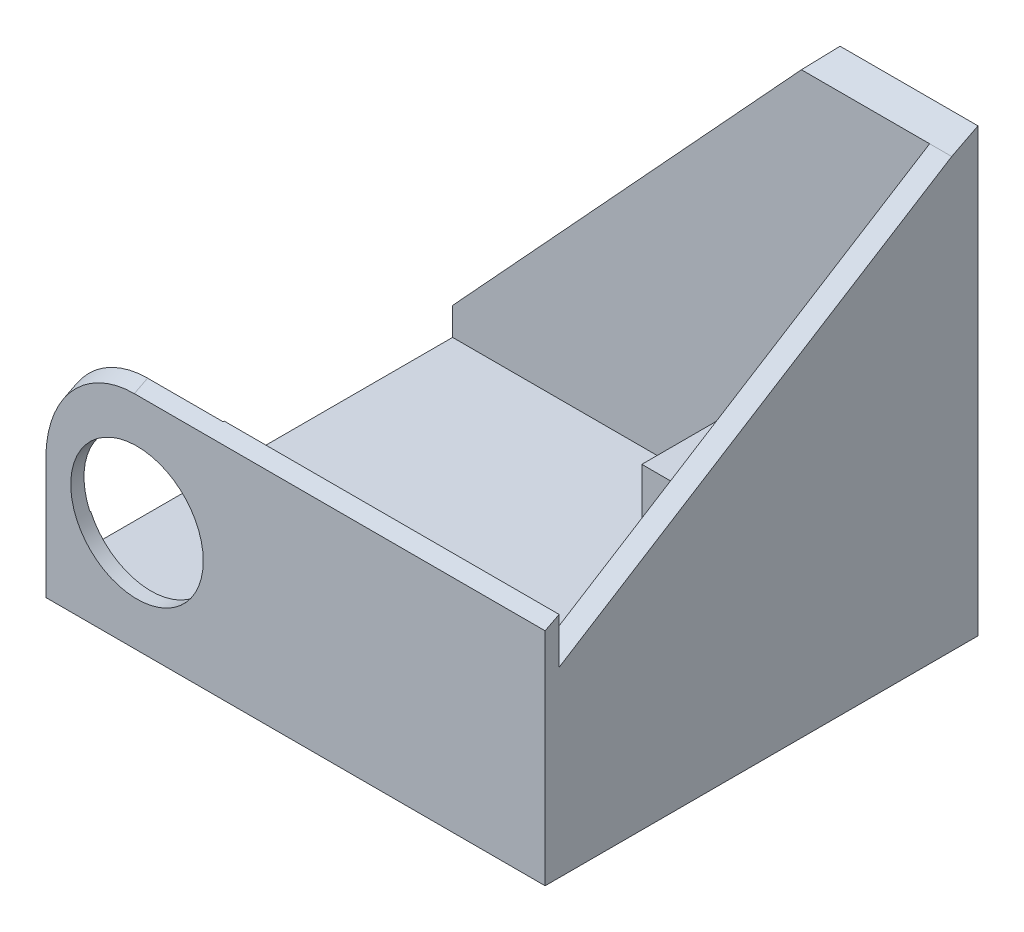
ISO-10303-21;
HEADER;
FILE_DESCRIPTION(('STEP AP214'),'2;1');
FILE_NAME('part.step','',(''),(''),'','','');
FILE_SCHEMA(('AUTOMOTIVE_DESIGN { 1 0 10303 214 1 1 1 1 }'));
ENDSEC;
DATA;
#1=APPLICATION_CONTEXT('core data for automotive mechanical design processes');
#2=APPLICATION_PROTOCOL_DEFINITION('international standard','automotive_design',2000,#1);
#3=PRODUCT_CONTEXT('',#1,'mechanical');
#4=PRODUCT('Part','Part','',(#3));
#5=PRODUCT_RELATED_PRODUCT_CATEGORY('part','',(#4));
#6=PRODUCT_DEFINITION_FORMATION('','',#4);
#7=PRODUCT_DEFINITION_CONTEXT('part definition',#1,'design');
#8=PRODUCT_DEFINITION('design','',#6,#7);
#9=PRODUCT_DEFINITION_SHAPE('','',#8);
#10=(LENGTH_UNIT() NAMED_UNIT(*) SI_UNIT(.MILLI.,.METRE.));
#11=(NAMED_UNIT(*) PLANE_ANGLE_UNIT() SI_UNIT($,.RADIAN.));
#12=(NAMED_UNIT(*) SI_UNIT($,.STERADIAN.) SOLID_ANGLE_UNIT());
#13=UNCERTAINTY_MEASURE_WITH_UNIT(LENGTH_MEASURE(1.E-05),#10,'distance_accuracy_value','');
#14=(GEOMETRIC_REPRESENTATION_CONTEXT(3) GLOBAL_UNCERTAINTY_ASSIGNED_CONTEXT((#13)) GLOBAL_UNIT_ASSIGNED_CONTEXT((#10,
#11,#12)) REPRESENTATION_CONTEXT('',''));
#15=CARTESIAN_POINT('',(0.,0.,0.));
#16=DIRECTION('',(0.,0.,1.));
#17=DIRECTION('',(1.,0.,0.));
#18=AXIS2_PLACEMENT_3D('',#15,#16,#17);
#19=CARTESIAN_POINT('',(34.3973116805746,0.,74.7961538461538));
#20=DIRECTION('',(0.735365944028076,-0.677670220950941,0.));
#21=DIRECTION('',(0.677670220950941,0.735365944028076,0.));
#22=AXIS2_PLACEMENT_3D('',#19,#20,#21);
#23=PLANE('',#22);
#24=DIRECTION('',(-0.677670220950941,-0.735365944028076,0.));
#25=VECTOR('',#24,1.);
#26=CARTESIAN_POINT('',(34.3973116805746,0.,74.622940805523));
#27=LINE('',#26,#25);
#28=CARTESIAN_POINT('',(-10.1877993750724,-48.3810137547802,74.622940805523));
#29=VERTEX_POINT('',#28);
#30=CARTESIAN_POINT('',(-21.706851972046,-60.8807794599871,74.622940805523));
#31=VERTEX_POINT('',#30);
#32=EDGE_CURVE('E195',#29,#31,#27,.T.);
#33=ORIENTED_EDGE('',*,*,#32,.T.);
#34=DIRECTION('',(0.,0.,1.));
#35=VECTOR('',#34,1.);
#36=CARTESIAN_POINT('',(-21.706851972046,-60.8807794599871,52.7961538461538));
#37=LINE('',#36,#35);
#38=CARTESIAN_POINT('',(-21.706851972046,-60.8807794599871,74.7961538461538));
#39=VERTEX_POINT('',#38);
#40=EDGE_CURVE('E172',#31,#39,#37,.T.);
#41=ORIENTED_EDGE('',*,*,#40,.T.);
#42=DIRECTION('',(-0.677670220950941,-0.735365944028076,0.));
#43=VECTOR('',#42,1.);
#44=CARTESIAN_POINT('',(34.3973116805746,0.,74.7961538461538));
#45=LINE('',#44,#43);
#46=CARTESIAN_POINT('',(-10.2692396821886,-48.4693877551021,74.7961538461538));
#47=VERTEX_POINT('',#46);
#48=EDGE_CURVE('E278',#47,#39,#45,.T.);
#49=ORIENTED_EDGE('',*,*,#48,.F.);
#50=DIRECTION('',(-0.386301816628273,-0.419190915112051,0.821614193619619));
#51=VECTOR('',#50,1.);
#52=CARTESIAN_POINT('',(19.6578961216158,-15.9943050496246,11.144991743418));
#53=LINE('',#52,#51);
#54=EDGE_CURVE('E201',#29,#47,#53,.T.);
#55=ORIENTED_EDGE('',*,*,#54,.F.);
#56=EDGE_LOOP('',(#33,#41,#49,#55));
#57=FACE_BOUND('',#56,.T.);
#58=ADVANCED_FACE('F39',(#57),#23,.F.);
#59=CARTESIAN_POINT('',(-47.3730769230769,-95.,-14.2532520853755));
#60=DIRECTION('',(0.,0.,-1.));
#61=DIRECTION('',(-1.,0.,0.));
#62=AXIS2_PLACEMENT_3D('',#59,#60,#61);
#63=PLANE('',#62);
#64=DIRECTION('',(0.,-1.,0.));
#65=VECTOR('',#64,1.);
#66=CARTESIAN_POINT('',(23.9396218920728,-70.,-14.2532520853755));
#67=LINE('',#66,#65);
#68=CARTESIAN_POINT('',(23.9396218920728,-70.,-14.2532520853755));
#69=VERTEX_POINT('',#68);
#70=CARTESIAN_POINT('',(23.9396218920728,-95.,-14.2532520853755));
#71=VERTEX_POINT('',#70);
#72=EDGE_CURVE('E411',#69,#71,#67,.T.);
#73=ORIENTED_EDGE('',*,*,#72,.F.);
#74=DIRECTION('',(-1.,0.,0.));
#75=VECTOR('',#74,1.);
#76=CARTESIAN_POINT('',(23.9396218920728,-70.,-14.2532520853755));
#77=LINE('',#76,#75);
#78=CARTESIAN_POINT('',(60.626923076923,-70.,-14.2532520853755));
#79=VERTEX_POINT('',#78);
#80=EDGE_CURVE('E414',#79,#69,#77,.T.);
#81=ORIENTED_EDGE('',*,*,#80,.F.);
#82=DIRECTION('',(0.,1.,0.));
#83=VECTOR('',#82,1.);
#84=CARTESIAN_POINT('',(60.626923076923,-95.,-14.2532520853755));
#85=LINE('',#84,#83);
#86=CARTESIAN_POINT('',(60.626923076923,-3.03601738187281,-14.2532520853755));
#87=VERTEX_POINT('',#86);
#88=EDGE_CURVE('E399',#79,#87,#85,.T.);
#89=ORIENTED_EDGE('',*,*,#88,.T.);
#90=DIRECTION('',(1.,0.,0.));
#91=VECTOR('',#90,1.);
#92=CARTESIAN_POINT('',(-64.3730769230769,-3.03601738187279,-14.2532520853755));
#93=LINE('',#92,#91);
#94=CARTESIAN_POINT('',(31.5994957269082,-3.03601738187281,-14.2532520853755));
#95=VERTEX_POINT('',#94);
#96=EDGE_CURVE('E288',#95,#87,#93,.T.);
#97=ORIENTED_EDGE('',*,*,#96,.F.);
#98=DIRECTION('',(0.677670220950941,0.735365944028076,0.));
#99=VECTOR('',#98,1.);
#100=CARTESIAN_POINT('',(34.3973116805746,0.,-14.2532520853755));
#101=LINE('',#100,#99);
#102=CARTESIAN_POINT('',(-47.3730769230769,-88.732184401858,-14.2532520853755));
#103=VERTEX_POINT('',#102);
#104=EDGE_CURVE('E178',#103,#95,#101,.T.);
#105=ORIENTED_EDGE('',*,*,#104,.F.);
#106=DIRECTION('',(0.,1.,0.));
#107=VECTOR('',#106,1.);
#108=CARTESIAN_POINT('',(-47.3730769230769,-95.,-14.2532520853755));
#109=LINE('',#108,#107);
#110=CARTESIAN_POINT('',(-47.3730769230769,-95.,-14.2532520853755));
#111=VERTEX_POINT('',#110);
#112=EDGE_CURVE('E303',#111,#103,#109,.T.);
#113=ORIENTED_EDGE('',*,*,#112,.F.);
#114=DIRECTION('',(-1.,0.,0.));
#115=VECTOR('',#114,1.);
#116=CARTESIAN_POINT('',(-47.3730769230769,-95.,-14.2532520853755));
#117=LINE('',#116,#115);
#118=EDGE_CURVE('E371',#71,#111,#117,.T.);
#119=ORIENTED_EDGE('',*,*,#118,.F.);
#120=EDGE_LOOP('',(#73,#81,#89,#97,#105,#113,#119));
#121=FACE_BOUND('',#120,.T.);
#122=ADVANCED_FACE('F323',(#121),#63,.F.);
#123=CARTESIAN_POINT('',(0.,-95.,0.));
#124=DIRECTION('',(0.,1.,0.));
#125=DIRECTION('',(0.,0.,1.));
#126=AXIS2_PLACEMENT_3D('',#123,#124,#125);
#127=PLANE('',#126);
#128=DIRECTION('',(1.,0.,0.));
#129=VECTOR('',#128,1.);
#130=CARTESIAN_POINT('',(23.9396218920728,-95.,14.2149034499911));
#131=LINE('',#130,#129);
#132=CARTESIAN_POINT('',(23.9396218920728,-95.,14.2149034499911));
#133=VERTEX_POINT('',#132);
#134=CARTESIAN_POINT('',(60.626923076923,-95.,14.2149034499911));
#135=VERTEX_POINT('',#134);
#136=EDGE_CURVE('E415',#133,#135,#131,.T.);
#137=ORIENTED_EDGE('',*,*,#136,.F.);
#138=DIRECTION('',(0.,0.,1.));
#139=VECTOR('',#138,1.);
#140=CARTESIAN_POINT('',(23.9396218920728,-95.,-14.2532520853755));
#141=LINE('',#140,#139);
#142=EDGE_CURVE('E419',#71,#133,#141,.T.);
#143=ORIENTED_EDGE('',*,*,#142,.F.);
#144=ORIENTED_EDGE('',*,*,#118,.T.);
#145=DIRECTION('',(0.,0.,1.));
#146=VECTOR('',#145,1.);
#147=CARTESIAN_POINT('',(-47.3730769230769,-95.,-14.2532520853755));
#148=LINE('',#147,#146);
#149=CARTESIAN_POINT('',(-47.3730769230769,-95.,74.622940805523));
#150=VERTEX_POINT('',#149);
#151=EDGE_CURVE('E379',#111,#150,#148,.T.);
#152=ORIENTED_EDGE('',*,*,#151,.T.);
#153=DIRECTION('',(1.,0.,0.));
#154=VECTOR('',#153,1.);
#155=CARTESIAN_POINT('',(-47.3730769230769,-95.,74.622940805523));
#156=LINE('',#155,#154);
#157=CARTESIAN_POINT('',(60.6269230769231,-95.,74.622940805523));
#158=VERTEX_POINT('',#157);
#159=EDGE_CURVE('E375',#150,#158,#156,.T.);
#160=ORIENTED_EDGE('',*,*,#159,.T.);
#161=DIRECTION('',(0.,0.,-1.));
#162=VECTOR('',#161,1.);
#163=CARTESIAN_POINT('',(60.6269230769231,-95.,74.622940805523));
#164=LINE('',#163,#162);
#165=EDGE_CURVE('E391',#158,#135,#164,.T.);
#166=ORIENTED_EDGE('',*,*,#165,.T.);
#167=EDGE_LOOP('',(#137,#143,#144,#152,#160,#166));
#168=FACE_BOUND('',#167,.T.);
#169=ADVANCED_FACE('F328',(#168),#127,.T.);
#170=CARTESIAN_POINT('',(60.626923076923,0.,0.));
#171=DIRECTION('',(1.,0.,0.));
#172=DIRECTION('',(0.,0.,-1.));
#173=AXIS2_PLACEMENT_3D('',#170,#171,#172);
#174=PLANE('',#173);
#175=DIRECTION('',(0.,-1.,0.));
#176=VECTOR('',#175,1.);
#177=CARTESIAN_POINT('',(60.626923076923,-70.,14.2149034499911));
#178=LINE('',#177,#176);
#179=CARTESIAN_POINT('',(60.6269230769231,-70.,14.2149034499911));
#180=VERTEX_POINT('',#179);
#181=EDGE_CURVE('E407',#180,#135,#178,.T.);
#182=ORIENTED_EDGE('',*,*,#181,.T.);
#183=ORIENTED_EDGE('',*,*,#165,.F.);
#184=DIRECTION('',(0.,-1.,0.));
#185=VECTOR('',#184,1.);
#186=CARTESIAN_POINT('',(60.6269230769231,-58.7383586760286,74.622940805523));
#187=LINE('',#186,#185);
#188=CARTESIAN_POINT('',(60.6269230769231,-58.7383586760286,74.622940805523));
#189=VERTEX_POINT('',#188);
#190=EDGE_CURVE('E386',#189,#158,#187,.T.);
#191=ORIENTED_EDGE('',*,*,#190,.F.);
#192=DIRECTION('',(0.,-0.531059263131155,0.847334679475941));
#193=VECTOR('',#192,1.);
#194=CARTESIAN_POINT('',(60.626923076923,-3.03601738187284,-14.2532520853755));
#195=LINE('',#194,#193);
#196=EDGE_CURVE('E395',#87,#189,#195,.T.);
#197=ORIENTED_EDGE('',*,*,#196,.F.);
#198=ORIENTED_EDGE('',*,*,#88,.F.);
#199=DIRECTION('',(0.,0.,-1.));
#200=VECTOR('',#199,1.);
#201=CARTESIAN_POINT('',(60.626923076923,-70.,-14.2532520853755));
#202=LINE('',#201,#200);
#203=EDGE_CURVE('E426',#180,#79,#202,.T.);
#204=ORIENTED_EDGE('',*,*,#203,.F.);
#205=EDGE_LOOP('',(#182,#183,#191,#197,#198,#204));
#206=FACE_BOUND('',#205,.T.);
#207=ADVANCED_FACE('F345',(#206),#174,.F.);
#208=CARTESIAN_POINT('',(-64.3730769230769,0.,-20.2038461538461));
#209=DIRECTION('',(0.,-0.890761869708233,-0.454470341687874));
#210=DIRECTION('',(0.,0.454470341687874,-0.890761869708233));
#211=AXIS2_PLACEMENT_3D('',#208,#209,#210);
#212=PLANE('',#211);
#213=CARTESIAN_POINT('',(34.3973116805746,0.,-20.2038461538462));
#214=VERTEX_POINT('',#213);
#215=EDGE_CURVE('E196',#214,#95,#53,.T.);
#216=ORIENTED_EDGE('',*,*,#215,.T.);
#217=ORIENTED_EDGE('',*,*,#96,.T.);
#218=DIRECTION('',(1.,0.,0.));
#219=VECTOR('',#218,1.);
#220=CARTESIAN_POINT('',(60.626923076923,-3.03601738187284,-14.2532520853755));
#221=LINE('',#220,#219);
#222=CARTESIAN_POINT('',(65.6269230769231,-3.03601738187284,-14.2532520853755));
#223=VERTEX_POINT('',#222);
#224=EDGE_CURVE('E355',#87,#223,#221,.T.);
#225=ORIENTED_EDGE('',*,*,#224,.T.);
#226=DIRECTION('',(0.,0.454470341687874,-0.890761869708233));
#227=VECTOR('',#226,1.);
#228=CARTESIAN_POINT('',(65.626923076923,0.,-20.2038461538462));
#229=LINE('',#228,#227);
#230=CARTESIAN_POINT('',(65.626923076923,0.,-20.2038461538462));
#231=VERTEX_POINT('',#230);
#232=EDGE_CURVE('E237',#223,#231,#229,.T.);
#233=ORIENTED_EDGE('',*,*,#232,.T.);
#234=DIRECTION('',(-1.,0.,0.));
#235=VECTOR('',#234,1.);
#236=CARTESIAN_POINT('',(-47.3730769230769,0.,-20.2038461538462));
#237=LINE('',#236,#235);
#238=EDGE_CURVE('E229',#231,#214,#237,.T.);
#239=ORIENTED_EDGE('',*,*,#238,.T.);
#240=EDGE_LOOP('',(#216,#217,#225,#233,#239));
#241=FACE_BOUND('',#240,.T.);
#242=ADVANCED_FACE('F334',(#241),#212,.F.);
#243=DIRECTION('',(0.,0.,-1.));
#244=VECTOR('',#243,1.);
#245=CARTESIAN_POINT('',(-47.3730769230769,-88.732184401858,74.7961538461538));
#246=LINE('',#245,#244);
#247=CARTESIAN_POINT('',(-47.3730769230769,-88.732184401858,-20.2038461538462));
#248=VERTEX_POINT('',#247);
#249=EDGE_CURVE('E284',#103,#248,#246,.T.);
#250=ORIENTED_EDGE('',*,*,#249,.F.);
#251=ORIENTED_EDGE('',*,*,#104,.T.);
#252=ORIENTED_EDGE('',*,*,#215,.F.);
#253=DIRECTION('',(-0.677670220950941,-0.735365944028076,0.));
#254=VECTOR('',#253,1.);
#255=CARTESIAN_POINT('',(34.3973116805746,0.,-20.2038461538462));
#256=LINE('',#255,#254);
#257=EDGE_CURVE('E286',#214,#248,#256,.T.);
#258=ORIENTED_EDGE('',*,*,#257,.T.);
#259=EDGE_LOOP('',(#250,#251,#252,#258));
#260=FACE_BOUND('',#259,.T.);
#261=ADVANCED_FACE('F306',(#260),#23,.F.);
#262=CARTESIAN_POINT('',(-47.3730769230769,-100.,-20.2038461538462));
#263=DIRECTION('',(-1.,0.,0.));
#264=DIRECTION('',(0.,0.,1.));
#265=AXIS2_PLACEMENT_3D('',#262,#263,#264);
#266=PLANE('',#265);
#267=DIRECTION('',(0.,1.,0.));
#268=VECTOR('',#267,1.);
#269=CARTESIAN_POINT('',(-47.3730769230769,-100.,77.7961538461538));
#270=LINE('',#269,#268);
#271=CARTESIAN_POINT('',(-47.3730769230769,-100.,77.7961538461538));
#272=VERTEX_POINT('',#271);
#273=CARTESIAN_POINT('',(-47.3730769230769,-72.4526898603675,77.7961538461538));
#274=VERTEX_POINT('',#273);
#275=EDGE_CURVE('E254',#272,#274,#270,.T.);
#276=ORIENTED_EDGE('',*,*,#275,.T.);
#277=DIRECTION('',(0.,-0.454470341687874,0.890761869708233));
#278=VECTOR('',#277,1.);
#279=CARTESIAN_POINT('',(-47.3730769230769,-66.2846251492667,65.7067470123964));
#280=LINE('',#279,#278);
#281=CARTESIAN_POINT('',(-47.3730769230769,-70.9220776154695,74.7961538461538));
#282=VERTEX_POINT('',#281);
#283=EDGE_CURVE('E48',#274,#282,#280,.F.);
#284=ORIENTED_EDGE('',*,*,#283,.T.);
#285=DIRECTION('',(0.,1.,0.));
#286=VECTOR('',#285,1.);
#287=CARTESIAN_POINT('',(-47.3730769230769,-88.732184401858,74.7961538461538));
#288=LINE('',#287,#286);
#289=CARTESIAN_POINT('',(-47.3730769230769,-88.732184401858,74.7961538461538));
#290=VERTEX_POINT('',#289);
#291=EDGE_CURVE('E280',#290,#282,#288,.T.);
#292=ORIENTED_EDGE('',*,*,#291,.F.);
#293=CARTESIAN_POINT('',(-47.3730769230769,-88.732184401858,74.622940805523));
#294=VERTEX_POINT('',#293);
#295=EDGE_CURVE('E293',#290,#294,#246,.T.);
#296=ORIENTED_EDGE('',*,*,#295,.T.);
#297=DIRECTION('',(0.,1.,0.));
#298=VECTOR('',#297,1.);
#299=CARTESIAN_POINT('',(-47.3730769230769,-95.,74.622940805523));
#300=LINE('',#299,#298);
#301=EDGE_CURVE('E192',#150,#294,#300,.T.);
#302=ORIENTED_EDGE('',*,*,#301,.F.);
#303=ORIENTED_EDGE('',*,*,#151,.F.);
#304=ORIENTED_EDGE('',*,*,#112,.T.);
#305=ORIENTED_EDGE('',*,*,#249,.T.);
#306=DIRECTION('',(0.,1.,0.));
#307=VECTOR('',#306,1.);
#308=CARTESIAN_POINT('',(-47.3730769230769,-100.,-20.2038461538462));
#309=LINE('',#308,#307);
#310=CARTESIAN_POINT('',(-47.3730769230769,-100.,-20.2038461538462));
#311=VERTEX_POINT('',#310);
#312=EDGE_CURVE('E256',#311,#248,#309,.T.);
#313=ORIENTED_EDGE('',*,*,#312,.F.);
#314=DIRECTION('',(0.,0.,1.));
#315=VECTOR('',#314,1.);
#316=CARTESIAN_POINT('',(-47.3730769230769,-100.,-20.2038461538462));
#317=LINE('',#316,#315);
#318=EDGE_CURVE('E235',#311,#272,#317,.T.);
#319=ORIENTED_EDGE('',*,*,#318,.T.);
#320=EDGE_LOOP('',(#276,#284,#292,#296,#302,#303,#304,#305,#313,#319));
#321=FACE_BOUND('',#320,.T.);
#322=ADVANCED_FACE('F299',(#321),#266,.T.);
#323=CARTESIAN_POINT('',(-47.3730769230769,-100.,-20.2038461538462));
#324=DIRECTION('',(0.,0.,-1.));
#325=DIRECTION('',(-1.,0.,0.));
#326=AXIS2_PLACEMENT_3D('',#323,#324,#325);
#327=PLANE('',#326);
#328=ORIENTED_EDGE('',*,*,#257,.F.);
#329=ORIENTED_EDGE('',*,*,#238,.F.);
#330=DIRECTION('',(0.,1.,0.));
#331=VECTOR('',#330,1.);
#332=CARTESIAN_POINT('',(65.626923076923,-100.,-20.2038461538462));
#333=LINE('',#332,#331);
#334=CARTESIAN_POINT('',(65.626923076923,-100.,-20.2038461538462));
#335=VERTEX_POINT('',#334);
#336=EDGE_CURVE('E260',#335,#231,#333,.T.);
#337=ORIENTED_EDGE('',*,*,#336,.F.);
#338=DIRECTION('',(-1.,0.,0.));
#339=VECTOR('',#338,1.);
#340=CARTESIAN_POINT('',(-47.3730769230769,-100.,-20.2038461538462));
#341=LINE('',#340,#339);
#342=EDGE_CURVE('E251',#335,#311,#341,.T.);
#343=ORIENTED_EDGE('',*,*,#342,.T.);
#344=ORIENTED_EDGE('',*,*,#312,.T.);
#345=EDGE_LOOP('',(#328,#329,#337,#343,#344));
#346=FACE_BOUND('',#345,.T.);
#347=ADVANCED_FACE('F309',(#346),#327,.T.);
#348=CARTESIAN_POINT('',(65.626923076923,-100.,-20.2038461538462));
#349=DIRECTION('',(1.,0.,0.));
#350=DIRECTION('',(0.,0.,-1.));
#351=AXIS2_PLACEMENT_3D('',#348,#349,#350);
#352=PLANE('',#351);
#353=ORIENTED_EDGE('',*,*,#232,.F.);
#354=DIRECTION('',(0.,-0.531059263131155,0.847334679475941));
#355=VECTOR('',#354,1.);
#356=CARTESIAN_POINT('',(65.626923076923,-3.03601738187284,-14.2532520853755));
#357=LINE('',#356,#355);
#358=CARTESIAN_POINT('',(65.6269230769231,-58.7383586760286,74.622940805523));
#359=VERTEX_POINT('',#358);
#360=EDGE_CURVE('E361',#223,#359,#357,.T.);
#361=ORIENTED_EDGE('',*,*,#360,.T.);
#362=DIRECTION('',(0.,1.,0.));
#363=VECTOR('',#362,1.);
#364=CARTESIAN_POINT('',(65.6269230769231,-95.,74.622940805523));
#365=LINE('',#364,#363);
#366=CARTESIAN_POINT('',(65.6269230769231,-48.3810137547802,74.622940805523));
#367=VERTEX_POINT('',#366);
#368=EDGE_CURVE('E360',#359,#367,#365,.T.);
#369=ORIENTED_EDGE('',*,*,#368,.T.);
#370=CARTESIAN_POINT('',(65.6269230769231,-50.,77.7961538461538));
#371=VERTEX_POINT('',#370);
#372=EDGE_CURVE('E230',#371,#367,#229,.T.);
#373=ORIENTED_EDGE('',*,*,#372,.F.);
#374=DIRECTION('',(0.,1.,0.));
#375=VECTOR('',#374,1.);
#376=CARTESIAN_POINT('',(65.6269230769231,-100.,77.7961538461538));
#377=LINE('',#376,#375);
#378=CARTESIAN_POINT('',(65.6269230769231,-100.,77.7961538461538));
#379=VERTEX_POINT('',#378);
#380=EDGE_CURVE('E227',#379,#371,#377,.T.);
#381=ORIENTED_EDGE('',*,*,#380,.F.);
#382=DIRECTION('',(0.,0.,-1.));
#383=VECTOR('',#382,1.);
#384=CARTESIAN_POINT('',(65.626923076923,-100.,-20.2038461538462));
#385=LINE('',#384,#383);
#386=EDGE_CURVE('E247',#379,#335,#385,.T.);
#387=ORIENTED_EDGE('',*,*,#386,.T.);
#388=ORIENTED_EDGE('',*,*,#336,.T.);
#389=EDGE_LOOP('',(#353,#361,#369,#373,#381,#387,#388));
#390=FACE_BOUND('',#389,.T.);
#391=ADVANCED_FACE('F359',(#390),#352,.T.);
#392=CARTESIAN_POINT('',(-47.3730769230769,-100.,77.7961538461538));
#393=DIRECTION('',(0.,0.,1.));
#394=DIRECTION('',(1.,0.,0.));
#395=AXIS2_PLACEMENT_3D('',#392,#393,#394);
#396=PLANE('',#395);
#397=CARTESIAN_POINT('',(-26.7711990516286,-75.,77.7961538461538));
#398=DIRECTION('',(0.,0.,1.));
#399=DIRECTION('',(1.,0.,0.));
#400=AXIS2_PLACEMENT_3D('',#397,#398,#399);
#401=CIRCLE('',#400,15.);
#402=CARTESIAN_POINT('',(-11.7711990516286,-75.,77.7961538461538));
#403=VERTEX_POINT('',#402);
#404=EDGE_CURVE('E188',#403,#403,#401,.T.);
#405=ORIENTED_EDGE('',*,*,#404,.F.);
#406=EDGE_LOOP('',(#405));
#407=FACE_BOUND('',#406,.T.);
#408=DIRECTION('',(1.,0.,0.));
#409=VECTOR('',#408,1.);
#410=CARTESIAN_POINT('',(-64.3730769230769,-50.,77.7961538461539));
#411=LINE('',#410,#409);
#412=CARTESIAN_POINT('',(-27.3730769230769,-50.,77.7961538461539));
#413=VERTEX_POINT('',#412);
#414=EDGE_CURVE('E218',#413,#371,#411,.T.);
#415=ORIENTED_EDGE('',*,*,#414,.F.);
#416=CARTESIAN_POINT('',(-27.3730769230769,-72.4526898603674,77.7961538461538));
#417=DIRECTION('',(0.,0.,1.));
#418=DIRECTION('',(0.,1.,0.));
#419=AXIS2_PLACEMENT_3D('',#416,#417,#418);
#420=ELLIPSE('',#419,22.4526898603675,20.);
#421=EDGE_CURVE('E62',#413,#274,#420,.T.);
#422=ORIENTED_EDGE('',*,*,#421,.T.);
#423=ORIENTED_EDGE('',*,*,#275,.F.);
#424=DIRECTION('',(1.,0.,0.));
#425=VECTOR('',#424,1.);
#426=CARTESIAN_POINT('',(-47.3730769230769,-100.,77.7961538461538));
#427=LINE('',#426,#425);
#428=EDGE_CURVE('E244',#272,#379,#427,.T.);
#429=ORIENTED_EDGE('',*,*,#428,.T.);
#430=ORIENTED_EDGE('',*,*,#380,.T.);
#431=EDGE_LOOP('',(#415,#422,#423,#429,#430));
#432=FACE_BOUND('',#431,.T.);
#433=ADVANCED_FACE('F225',(#407,#432),#396,.T.);
#434=CARTESIAN_POINT('',(0.,-100.,0.));
#435=DIRECTION('',(0.,1.,0.));
#436=DIRECTION('',(0.,0.,1.));
#437=AXIS2_PLACEMENT_3D('',#434,#435,#436);
#438=PLANE('',#437);
#439=ORIENTED_EDGE('',*,*,#318,.F.);
#440=ORIENTED_EDGE('',*,*,#342,.F.);
#441=ORIENTED_EDGE('',*,*,#386,.F.);
#442=ORIENTED_EDGE('',*,*,#428,.F.);
#443=EDGE_LOOP('',(#439,#440,#441,#442));
#444=FACE_BOUND('',#443,.T.);
#445=ADVANCED_FACE('F313',(#444),#438,.F.);
#446=DIRECTION('',(-1.,0.,0.));
#447=VECTOR('',#446,1.);
#448=CARTESIAN_POINT('',(-64.3730769230769,-48.469387755102,74.7961538461538));
#449=LINE('',#448,#447);
#450=CARTESIAN_POINT('',(-27.3730769230769,-48.469387755102,74.7961538461538));
#451=VERTEX_POINT('',#450);
#452=EDGE_CURVE('E221',#47,#451,#449,.T.);
#453=ORIENTED_EDGE('',*,*,#452,.T.);
#454=DIRECTION('',(0.,-0.454470341687874,0.890761869708233));
#455=VECTOR('',#454,1.);
#456=CARTESIAN_POINT('',(-27.3730769230769,-50.,77.7961538461539));
#457=LINE('',#456,#455);
#458=EDGE_CURVE('E177',#451,#413,#457,.T.);
#459=ORIENTED_EDGE('',*,*,#458,.T.);
#460=ORIENTED_EDGE('',*,*,#414,.T.);
#461=ORIENTED_EDGE('',*,*,#372,.T.);
#462=DIRECTION('',(-1.,0.,0.));
#463=VECTOR('',#462,1.);
#464=CARTESIAN_POINT('',(-64.3730769230769,-48.3810137547802,74.622940805523));
#465=LINE('',#464,#463);
#466=EDGE_CURVE('E272',#367,#29,#465,.T.);
#467=ORIENTED_EDGE('',*,*,#466,.T.);
#468=ORIENTED_EDGE('',*,*,#54,.T.);
#469=EDGE_LOOP('',(#453,#459,#460,#461,#467,#468));
#470=FACE_BOUND('',#469,.T.);
#471=ADVANCED_FACE('F216',(#470),#212,.F.);
#472=CARTESIAN_POINT('',(-40.4305428946781,-81.1985744955875,74.7961538461538));
#473=VERTEX_POINT('',#472);
#474=EDGE_CURVE('E186',#473,#290,#45,.T.);
#475=ORIENTED_EDGE('',*,*,#474,.F.);
#476=DIRECTION('',(0.,0.,1.));
#477=VECTOR('',#476,1.);
#478=CARTESIAN_POINT('',(-40.4305428946781,-81.1985744955875,52.7961538461538));
#479=LINE('',#478,#477);
#480=CARTESIAN_POINT('',(-40.4305428946781,-81.1985744955875,74.622940805523));
#481=VERTEX_POINT('',#480);
#482=EDGE_CURVE('E169',#473,#481,#479,.F.);
#483=ORIENTED_EDGE('',*,*,#482,.T.);
#484=EDGE_CURVE('E184',#481,#294,#27,.T.);
#485=ORIENTED_EDGE('',*,*,#484,.T.);
#486=ORIENTED_EDGE('',*,*,#295,.F.);
#487=EDGE_LOOP('',(#475,#483,#485,#486));
#488=FACE_BOUND('',#487,.T.);
#489=ADVANCED_FACE('F182',(#488),#23,.F.);
#490=CARTESIAN_POINT('',(0.,0.,74.7961538461538));
#491=DIRECTION('',(0.,0.,1.));
#492=DIRECTION('',(1.,0.,0.));
#493=AXIS2_PLACEMENT_3D('',#490,#491,#492);
#494=PLANE('',#493);
#495=ORIENTED_EDGE('',*,*,#291,.T.);
#496=CARTESIAN_POINT('',(-27.3730769230769,-70.9220776154695,74.7961538461538));
#497=DIRECTION('',(0.,0.,1.));
#498=DIRECTION('',(0.,1.,0.));
#499=AXIS2_PLACEMENT_3D('',#496,#497,#498);
#500=ELLIPSE('',#499,22.4526898603674,20.);
#501=EDGE_CURVE('E11',#282,#451,#500,.F.);
#502=ORIENTED_EDGE('',*,*,#501,.T.);
#503=ORIENTED_EDGE('',*,*,#452,.F.);
#504=ORIENTED_EDGE('',*,*,#48,.T.);
#505=CARTESIAN_POINT('',(-26.7711990516286,-75.,74.7961538461538));
#506=DIRECTION('',(0.,0.,1.));
#507=DIRECTION('',(1.,0.,0.));
#508=AXIS2_PLACEMENT_3D('',#505,#506,#507);
#509=CIRCLE('',#508,15.);
#510=EDGE_CURVE('E423',#39,#473,#509,.T.);
#511=ORIENTED_EDGE('',*,*,#510,.T.);
#512=ORIENTED_EDGE('',*,*,#474,.T.);
#513=EDGE_LOOP('',(#495,#502,#503,#504,#511,#512));
#514=FACE_BOUND('',#513,.T.);
#515=ADVANCED_FACE('F277',(#514),#494,.F.);
#516=CARTESIAN_POINT('',(-47.3730769230769,-95.,74.622940805523));
#517=DIRECTION('',(0.,0.,1.));
#518=DIRECTION('',(1.,0.,0.));
#519=AXIS2_PLACEMENT_3D('',#516,#517,#518);
#520=PLANE('',#519);
#521=ORIENTED_EDGE('',*,*,#484,.F.);
#522=CARTESIAN_POINT('',(-26.7711990516286,-75.,74.622940805523));
#523=DIRECTION('',(0.,0.,1.));
#524=DIRECTION('',(1.,0.,0.));
#525=AXIS2_PLACEMENT_3D('',#522,#523,#524);
#526=CIRCLE('',#525,15.);
#527=EDGE_CURVE('E166',#481,#31,#526,.T.);
#528=ORIENTED_EDGE('',*,*,#527,.T.);
#529=ORIENTED_EDGE('',*,*,#32,.F.);
#530=ORIENTED_EDGE('',*,*,#466,.F.);
#531=ORIENTED_EDGE('',*,*,#368,.F.);
#532=DIRECTION('',(1.,0.,0.));
#533=VECTOR('',#532,1.);
#534=CARTESIAN_POINT('',(60.6269230769231,-58.7383586760286,74.622940805523));
#535=LINE('',#534,#533);
#536=EDGE_CURVE('E383',#189,#359,#535,.T.);
#537=ORIENTED_EDGE('',*,*,#536,.F.);
#538=ORIENTED_EDGE('',*,*,#190,.T.);
#539=ORIENTED_EDGE('',*,*,#159,.F.);
#540=ORIENTED_EDGE('',*,*,#301,.T.);
#541=EDGE_LOOP('',(#521,#528,#529,#530,#531,#537,#538,#539,#540));
#542=FACE_BOUND('',#541,.T.);
#543=ADVANCED_FACE('F190',(#542),#520,.F.);
#544=CARTESIAN_POINT('',(60.626923076923,-3.03601738187284,-14.2532520853755));
#545=DIRECTION('',(0.,0.847334679475941,0.531059263131155));
#546=DIRECTION('',(0.,-0.531059263131155,0.847334679475941));
#547=AXIS2_PLACEMENT_3D('',#544,#545,#546);
#548=PLANE('',#547);
#549=ORIENTED_EDGE('',*,*,#360,.F.);
#550=ORIENTED_EDGE('',*,*,#224,.F.);
#551=ORIENTED_EDGE('',*,*,#196,.T.);
#552=ORIENTED_EDGE('',*,*,#536,.T.);
#553=EDGE_LOOP('',(#549,#550,#551,#552));
#554=FACE_BOUND('',#553,.T.);
#555=ADVANCED_FACE('F473',(#554),#548,.T.);
#556=CARTESIAN_POINT('',(23.9396218920728,-70.,-14.2532520853755));
#557=DIRECTION('',(1.,0.,0.));
#558=DIRECTION('',(0.,0.,-1.));
#559=AXIS2_PLACEMENT_3D('',#556,#557,#558);
#560=PLANE('',#559);
#561=ORIENTED_EDGE('',*,*,#142,.T.);
#562=DIRECTION('',(0.,-1.,0.));
#563=VECTOR('',#562,1.);
#564=CARTESIAN_POINT('',(23.9396218920728,-70.,14.2149034499911));
#565=LINE('',#564,#563);
#566=CARTESIAN_POINT('',(23.9396218920728,-70.,14.2149034499911));
#567=VERTEX_POINT('',#566);
#568=EDGE_CURVE('E392',#567,#133,#565,.T.);
#569=ORIENTED_EDGE('',*,*,#568,.F.);
#570=DIRECTION('',(0.,0.,1.));
#571=VECTOR('',#570,1.);
#572=CARTESIAN_POINT('',(23.9396218920728,-70.,-14.2532520853755));
#573=LINE('',#572,#571);
#574=EDGE_CURVE('E418',#69,#567,#573,.T.);
#575=ORIENTED_EDGE('',*,*,#574,.F.);
#576=ORIENTED_EDGE('',*,*,#72,.T.);
#577=EDGE_LOOP('',(#561,#569,#575,#576));
#578=FACE_BOUND('',#577,.T.);
#579=ADVANCED_FACE('F477',(#578),#560,.F.);
#580=CARTESIAN_POINT('',(23.9396218920728,-70.,14.2149034499911));
#581=DIRECTION('',(0.,0.,-1.));
#582=DIRECTION('',(-1.,0.,0.));
#583=AXIS2_PLACEMENT_3D('',#580,#581,#582);
#584=PLANE('',#583);
#585=ORIENTED_EDGE('',*,*,#136,.T.);
#586=ORIENTED_EDGE('',*,*,#181,.F.);
#587=DIRECTION('',(1.,0.,0.));
#588=VECTOR('',#587,1.);
#589=CARTESIAN_POINT('',(23.9396218920728,-70.,14.2149034499911));
#590=LINE('',#589,#588);
#591=EDGE_CURVE('E429',#567,#180,#590,.T.);
#592=ORIENTED_EDGE('',*,*,#591,.F.);
#593=ORIENTED_EDGE('',*,*,#568,.T.);
#594=EDGE_LOOP('',(#585,#586,#592,#593));
#595=FACE_BOUND('',#594,.T.);
#596=ADVANCED_FACE('F509',(#595),#584,.F.);
#597=CARTESIAN_POINT('',(0.,-70.,0.));
#598=DIRECTION('',(0.,1.,0.));
#599=DIRECTION('',(0.,0.,1.));
#600=AXIS2_PLACEMENT_3D('',#597,#598,#599);
#601=PLANE('',#600);
#602=ORIENTED_EDGE('',*,*,#574,.T.);
#603=ORIENTED_EDGE('',*,*,#591,.T.);
#604=ORIENTED_EDGE('',*,*,#203,.T.);
#605=ORIENTED_EDGE('',*,*,#80,.T.);
#606=EDGE_LOOP('',(#602,#603,#604,#605));
#607=FACE_BOUND('',#606,.T.);
#608=ADVANCED_FACE('F319',(#607),#601,.T.);
#609=CARTESIAN_POINT('',(-26.7711990516286,-75.,52.7961538461538));
#610=DIRECTION('',(0.,0.,1.));
#611=DIRECTION('',(1.,0.,0.));
#612=AXIS2_PLACEMENT_3D('',#609,#610,#611);
#613=CYLINDRICAL_SURFACE('',#612,15.);
#614=ORIENTED_EDGE('',*,*,#404,.T.);
#615=EDGE_LOOP('',(#614));
#616=FACE_BOUND('',#615,.T.);
#617=ORIENTED_EDGE('',*,*,#40,.F.);
#618=ORIENTED_EDGE('',*,*,#527,.F.);
#619=ORIENTED_EDGE('',*,*,#482,.F.);
#620=ORIENTED_EDGE('',*,*,#510,.F.);
#621=EDGE_LOOP('',(#617,#618,#619,#620));
#622=FACE_BOUND('',#621,.T.);
#623=ADVANCED_FACE('F168',(#616,#622),#613,.F.);
#624=CARTESIAN_POINT('',(-27.3730769230769,-17.8152373941647,-29.2932529876036));
#625=DIRECTION('',(0.,0.454470341687874,-0.890761869708233));
#626=DIRECTION('',(0.,0.890761869708233,0.454470341687874));
#627=AXIS2_PLACEMENT_3D('',#624,#625,#626);
#628=CYLINDRICAL_SURFACE('',#627,20.);
#629=ORIENTED_EDGE('',*,*,#501,.F.);
#630=ORIENTED_EDGE('',*,*,#283,.F.);
#631=ORIENTED_EDGE('',*,*,#421,.F.);
#632=ORIENTED_EDGE('',*,*,#458,.F.);
#633=EDGE_LOOP('',(#629,#630,#631,#632));
#634=FACE_BOUND('',#633,.T.);
#635=ADVANCED_FACE('F41',(#634),#628,.T.);
#636=CLOSED_SHELL('',(#58,#122,#169,#207,#242,#261,#322,#347,#391,#433,#445,#471,#489,#515,#543,
#555,#579,#596,#608,#623,#635));
#637=MANIFOLD_SOLID_BREP('B2',#636);
#638=ADVANCED_BREP_SHAPE_REPRESENTATION('',(#18,#637),#14);
#639=SHAPE_DEFINITION_REPRESENTATION(#9,#638);
ENDSEC;
END-ISO-10303-21;
